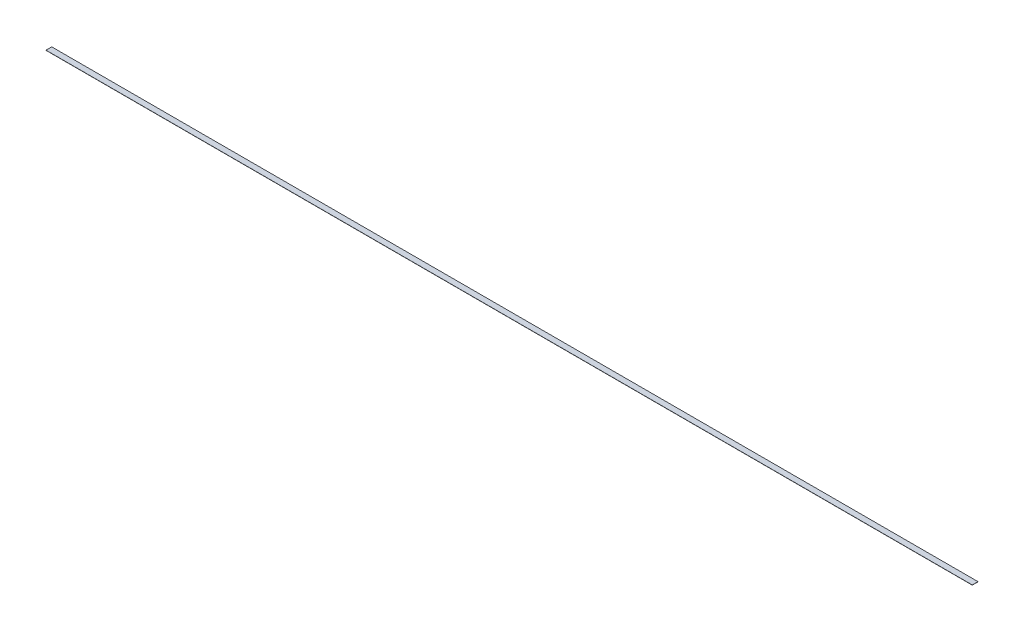
ISO-10303-21;
HEADER;
FILE_DESCRIPTION(('STEP AP214'),'2;1');
FILE_NAME('part.step','',(''),(''),'','','');
FILE_SCHEMA(('AUTOMOTIVE_DESIGN { 1 0 10303 214 1 1 1 1 }'));
ENDSEC;
DATA;
#1=APPLICATION_CONTEXT('core data for automotive mechanical design processes');
#2=APPLICATION_PROTOCOL_DEFINITION('international standard','automotive_design',2000,#1);
#3=PRODUCT_CONTEXT('',#1,'mechanical');
#4=PRODUCT('Part','Part','',(#3));
#5=PRODUCT_RELATED_PRODUCT_CATEGORY('part','',(#4));
#6=PRODUCT_DEFINITION_FORMATION('','',#4);
#7=PRODUCT_DEFINITION_CONTEXT('part definition',#1,'design');
#8=PRODUCT_DEFINITION('design','',#6,#7);
#9=PRODUCT_DEFINITION_SHAPE('','',#8);
#10=(LENGTH_UNIT() NAMED_UNIT(*) SI_UNIT(.MILLI.,.METRE.));
#11=(NAMED_UNIT(*) PLANE_ANGLE_UNIT() SI_UNIT($,.RADIAN.));
#12=(NAMED_UNIT(*) SI_UNIT($,.STERADIAN.) SOLID_ANGLE_UNIT());
#13=UNCERTAINTY_MEASURE_WITH_UNIT(LENGTH_MEASURE(1.E-05),#10,'distance_accuracy_value','');
#14=(GEOMETRIC_REPRESENTATION_CONTEXT(3) GLOBAL_UNCERTAINTY_ASSIGNED_CONTEXT((#13)) GLOBAL_UNIT_ASSIGNED_CONTEXT((#10,
#11,#12)) REPRESENTATION_CONTEXT('',''));
#15=CARTESIAN_POINT('',(0.,0.,0.));
#16=DIRECTION('',(0.,0.,1.));
#17=DIRECTION('',(1.,0.,0.));
#18=AXIS2_PLACEMENT_3D('',#15,#16,#17);
#19=CARTESIAN_POINT('',(0.,1.5875,0.));
#20=DIRECTION('',(1.,0.,0.));
#21=DIRECTION('',(0.,0.,-1.));
#22=AXIS2_PLACEMENT_3D('',#19,#20,#21);
#23=PLANE('',#22);
#24=DIRECTION('',(0.,0.,1.));
#25=VECTOR('',#24,1.);
#26=CARTESIAN_POINT('',(0.,0.,0.));
#27=LINE('',#26,#25);
#28=CARTESIAN_POINT('',(0.,0.,-50.8));
#29=VERTEX_POINT('',#28);
#30=CARTESIAN_POINT('',(0.,0.,0.));
#31=VERTEX_POINT('',#30);
#32=EDGE_CURVE('E98',#29,#31,#27,.T.);
#33=ORIENTED_EDGE('',*,*,#32,.T.);
#34=DIRECTION('',(0.,-1.,0.));
#35=VECTOR('',#34,1.);
#36=CARTESIAN_POINT('',(0.,1.5875,0.));
#37=LINE('',#36,#35);
#38=CARTESIAN_POINT('',(0.,1.5875,0.));
#39=VERTEX_POINT('',#38);
#40=EDGE_CURVE('E11',#39,#31,#37,.T.);
#41=ORIENTED_EDGE('',*,*,#40,.F.);
#42=DIRECTION('',(0.,0.,1.));
#43=VECTOR('',#42,1.);
#44=CARTESIAN_POINT('',(0.,1.5875,0.));
#45=LINE('',#44,#43);
#46=CARTESIAN_POINT('',(0.,1.5875,-50.8));
#47=VERTEX_POINT('',#46);
#48=EDGE_CURVE('E86',#47,#39,#45,.T.);
#49=ORIENTED_EDGE('',*,*,#48,.F.);
#50=DIRECTION('',(0.,-1.,0.));
#51=VECTOR('',#50,1.);
#52=CARTESIAN_POINT('',(0.,1.5875,-50.8));
#53=LINE('',#52,#51);
#54=EDGE_CURVE('E94',#47,#29,#53,.T.);
#55=ORIENTED_EDGE('',*,*,#54,.T.);
#56=EDGE_LOOP('',(#33,#41,#49,#55));
#57=FACE_BOUND('',#56,.T.);
#58=ADVANCED_FACE('F35',(#57),#23,.F.);
#59=CARTESIAN_POINT('',(0.,1.5875,0.));
#60=DIRECTION('',(0.,0.,-1.));
#61=DIRECTION('',(-1.,0.,0.));
#62=AXIS2_PLACEMENT_3D('',#59,#60,#61);
#63=PLANE('',#62);
#64=DIRECTION('',(1.,0.,0.));
#65=VECTOR('',#64,1.);
#66=CARTESIAN_POINT('',(0.,0.,0.));
#67=LINE('',#66,#65);
#68=CARTESIAN_POINT('',(8204.2,0.,0.));
#69=VERTEX_POINT('',#68);
#70=EDGE_CURVE('E90',#31,#69,#67,.T.);
#71=ORIENTED_EDGE('',*,*,#70,.T.);
#72=DIRECTION('',(0.,-1.,0.));
#73=VECTOR('',#72,1.);
#74=CARTESIAN_POINT('',(8204.2,1.5875,0.));
#75=LINE('',#74,#73);
#76=CARTESIAN_POINT('',(8204.2,1.5875,0.));
#77=VERTEX_POINT('',#76);
#78=EDGE_CURVE('E43',#77,#69,#75,.T.);
#79=ORIENTED_EDGE('',*,*,#78,.F.);
#80=DIRECTION('',(1.,0.,0.));
#81=VECTOR('',#80,1.);
#82=CARTESIAN_POINT('',(0.,1.5875,0.));
#83=LINE('',#82,#81);
#84=EDGE_CURVE('E81',#39,#77,#83,.T.);
#85=ORIENTED_EDGE('',*,*,#84,.F.);
#86=ORIENTED_EDGE('',*,*,#40,.T.);
#87=EDGE_LOOP('',(#71,#79,#85,#86));
#88=FACE_BOUND('',#87,.T.);
#89=ADVANCED_FACE('F89',(#88),#63,.F.);
#90=CARTESIAN_POINT('',(8204.2,1.5875,0.));
#91=DIRECTION('',(-1.,0.,0.));
#92=DIRECTION('',(0.,0.,1.));
#93=AXIS2_PLACEMENT_3D('',#90,#91,#92);
#94=PLANE('',#93);
#95=DIRECTION('',(0.,0.,-1.));
#96=VECTOR('',#95,1.);
#97=CARTESIAN_POINT('',(8204.2,0.,0.));
#98=LINE('',#97,#96);
#99=CARTESIAN_POINT('',(8204.2,0.,-50.8));
#100=VERTEX_POINT('',#99);
#101=EDGE_CURVE('E68',#69,#100,#98,.T.);
#102=ORIENTED_EDGE('',*,*,#101,.T.);
#103=DIRECTION('',(0.,-1.,0.));
#104=VECTOR('',#103,1.);
#105=CARTESIAN_POINT('',(8204.2,1.5875,-50.8));
#106=LINE('',#105,#104);
#107=CARTESIAN_POINT('',(8204.2,1.5875,-50.8));
#108=VERTEX_POINT('',#107);
#109=EDGE_CURVE('E91',#108,#100,#106,.T.);
#110=ORIENTED_EDGE('',*,*,#109,.F.);
#111=DIRECTION('',(0.,0.,-1.));
#112=VECTOR('',#111,1.);
#113=CARTESIAN_POINT('',(8204.2,1.5875,0.));
#114=LINE('',#113,#112);
#115=EDGE_CURVE('E84',#77,#108,#114,.T.);
#116=ORIENTED_EDGE('',*,*,#115,.F.);
#117=ORIENTED_EDGE('',*,*,#78,.T.);
#118=EDGE_LOOP('',(#102,#110,#116,#117));
#119=FACE_BOUND('',#118,.T.);
#120=ADVANCED_FACE('F92',(#119),#94,.F.);
#121=CARTESIAN_POINT('',(0.,1.5875,-50.8));
#122=DIRECTION('',(0.,0.,1.));
#123=DIRECTION('',(1.,0.,0.));
#124=AXIS2_PLACEMENT_3D('',#121,#122,#123);
#125=PLANE('',#124);
#126=DIRECTION('',(-1.,0.,0.));
#127=VECTOR('',#126,1.);
#128=CARTESIAN_POINT('',(0.,0.,-50.8));
#129=LINE('',#128,#127);
#130=EDGE_CURVE('E74',#100,#29,#129,.T.);
#131=ORIENTED_EDGE('',*,*,#130,.T.);
#132=ORIENTED_EDGE('',*,*,#54,.F.);
#133=DIRECTION('',(-1.,0.,0.));
#134=VECTOR('',#133,1.);
#135=CARTESIAN_POINT('',(0.,1.5875,-50.8));
#136=LINE('',#135,#134);
#137=EDGE_CURVE('E51',#108,#47,#136,.T.);
#138=ORIENTED_EDGE('',*,*,#137,.F.);
#139=ORIENTED_EDGE('',*,*,#109,.T.);
#140=EDGE_LOOP('',(#131,#132,#138,#139));
#141=FACE_BOUND('',#140,.T.);
#142=ADVANCED_FACE('F105',(#141),#125,.F.);
#143=CARTESIAN_POINT('',(0.,1.5875,0.));
#144=DIRECTION('',(0.,-1.,0.));
#145=DIRECTION('',(0.,0.,-1.));
#146=AXIS2_PLACEMENT_3D('',#143,#144,#145);
#147=PLANE('',#146);
#148=ORIENTED_EDGE('',*,*,#48,.T.);
#149=ORIENTED_EDGE('',*,*,#84,.T.);
#150=ORIENTED_EDGE('',*,*,#115,.T.);
#151=ORIENTED_EDGE('',*,*,#137,.T.);
#152=EDGE_LOOP('',(#148,#149,#150,#151));
#153=FACE_BOUND('',#152,.T.);
#154=ADVANCED_FACE('F82',(#153),#147,.F.);
#155=CARTESIAN_POINT('',(0.,0.,0.));
#156=DIRECTION('',(0.,-1.,0.));
#157=DIRECTION('',(0.,0.,-1.));
#158=AXIS2_PLACEMENT_3D('',#155,#156,#157);
#159=PLANE('',#158);
#160=ORIENTED_EDGE('',*,*,#32,.F.);
#161=ORIENTED_EDGE('',*,*,#130,.F.);
#162=ORIENTED_EDGE('',*,*,#101,.F.);
#163=ORIENTED_EDGE('',*,*,#70,.F.);
#164=EDGE_LOOP('',(#160,#161,#162,#163));
#165=FACE_BOUND('',#164,.T.);
#166=ADVANCED_FACE('F108',(#165),#159,.T.);
#167=CLOSED_SHELL('',(#58,#89,#120,#142,#154,#166));
#168=MANIFOLD_SOLID_BREP('B2',#167);
#169=ADVANCED_BREP_SHAPE_REPRESENTATION('',(#18,#168),#14);
#170=SHAPE_DEFINITION_REPRESENTATION(#9,#169);
ENDSEC;
END-ISO-10303-21;
